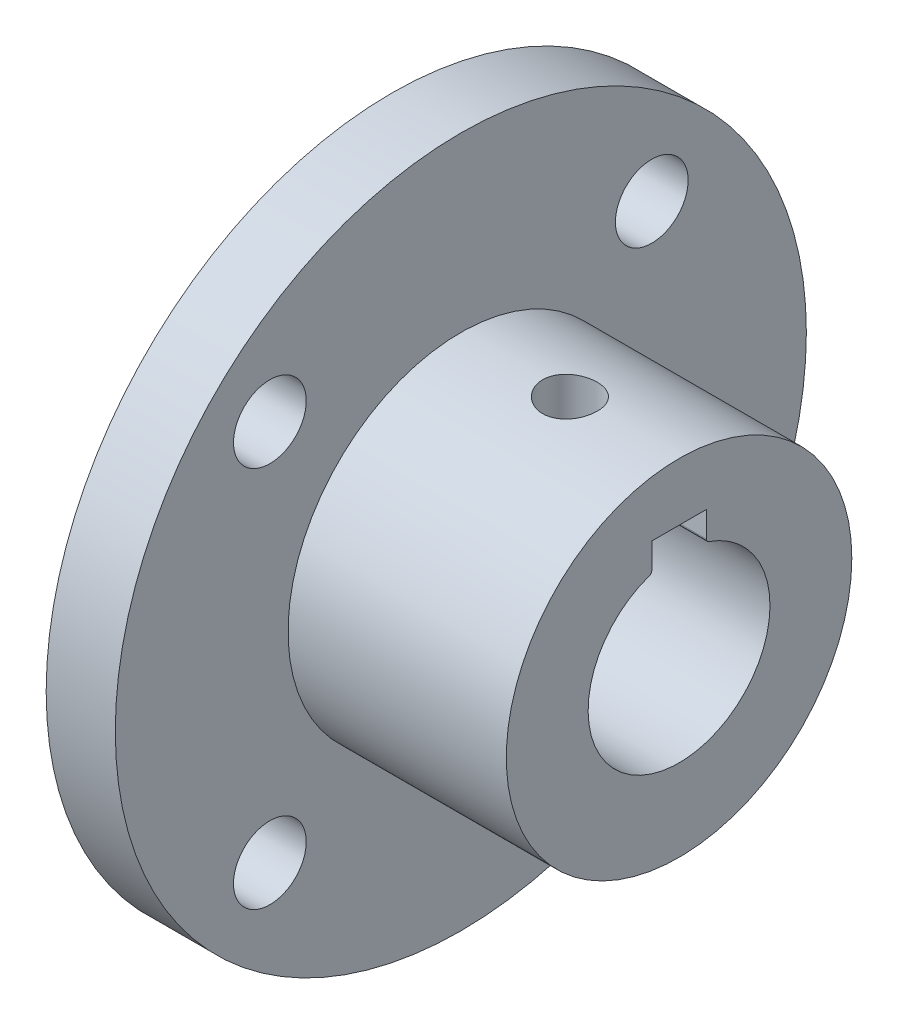
ISO-10303-21;
HEADER;
FILE_DESCRIPTION(('STEP AP214'),'2;1');
FILE_NAME('part.step','',(''),(''),'','','');
FILE_SCHEMA(('AUTOMOTIVE_DESIGN { 1 0 10303 214 1 1 1 1 }'));
ENDSEC;
DATA;
#1=APPLICATION_CONTEXT('core data for automotive mechanical design processes');
#2=APPLICATION_PROTOCOL_DEFINITION('international standard','automotive_design',2000,#1);
#3=PRODUCT_CONTEXT('',#1,'mechanical');
#4=PRODUCT('Part','Part','',(#3));
#5=PRODUCT_RELATED_PRODUCT_CATEGORY('part','',(#4));
#6=PRODUCT_DEFINITION_FORMATION('','',#4);
#7=PRODUCT_DEFINITION_CONTEXT('part definition',#1,'design');
#8=PRODUCT_DEFINITION('design','',#6,#7);
#9=PRODUCT_DEFINITION_SHAPE('','',#8);
#10=(LENGTH_UNIT() NAMED_UNIT(*) SI_UNIT(.MILLI.,.METRE.));
#11=(NAMED_UNIT(*) PLANE_ANGLE_UNIT() SI_UNIT($,.RADIAN.));
#12=(NAMED_UNIT(*) SI_UNIT($,.STERADIAN.) SOLID_ANGLE_UNIT());
#13=UNCERTAINTY_MEASURE_WITH_UNIT(LENGTH_MEASURE(1.E-05),#10,'distance_accuracy_value','');
#14=(GEOMETRIC_REPRESENTATION_CONTEXT(3) GLOBAL_UNCERTAINTY_ASSIGNED_CONTEXT((#13)) GLOBAL_UNIT_ASSIGNED_CONTEXT((#10,
#11,#12)) REPRESENTATION_CONTEXT('',''));
#15=CARTESIAN_POINT('',(0.,0.,0.));
#16=DIRECTION('',(0.,0.,1.));
#17=DIRECTION('',(1.,0.,0.));
#18=AXIS2_PLACEMENT_3D('',#15,#16,#17);
#19=CARTESIAN_POINT('',(-8.,6.31969600708473,1.5));
#20=DIRECTION('',(0.,1.,0.));
#21=DIRECTION('',(0.,0.,1.));
#22=AXIS2_PLACEMENT_3D('',#19,#20,#21);
#23=PLANE('',#22);
#24=DIRECTION('',(1.,0.,0.));
#25=VECTOR('',#24,1.);
#26=CARTESIAN_POINT('',(-8.,6.31969600708473,1.5));
#27=LINE('',#26,#25);
#28=CARTESIAN_POINT('',(6.,6.31969600708473,1.5));
#29=VERTEX_POINT('',#28);
#30=CARTESIAN_POINT('',(12.,6.31969600708473,1.5));
#31=VERTEX_POINT('',#30);
#32=EDGE_CURVE('E102',#29,#31,#27,.T.);
#33=ORIENTED_EDGE('',*,*,#32,.F.);
#34=CARTESIAN_POINT('',(6.,6.31969600708473,0.));
#35=DIRECTION('',(0.,-1.,0.));
#36=DIRECTION('',(0.,0.,-1.));
#37=AXIS2_PLACEMENT_3D('',#34,#35,#36);
#38=CIRCLE('',#37,1.5);
#39=CARTESIAN_POINT('',(6.,6.31969600708473,-1.5));
#40=VERTEX_POINT('',#39);
#41=EDGE_CURVE('E47',#40,#29,#38,.T.);
#42=ORIENTED_EDGE('',*,*,#41,.F.);
#43=DIRECTION('',(1.,0.,0.));
#44=VECTOR('',#43,1.);
#45=CARTESIAN_POINT('',(-8.,6.31969600708473,-1.5));
#46=LINE('',#45,#44);
#47=CARTESIAN_POINT('',(12.,6.31969600708473,-1.5));
#48=VERTEX_POINT('',#47);
#49=EDGE_CURVE('E100',#40,#48,#46,.T.);
#50=ORIENTED_EDGE('',*,*,#49,.T.);
#51=DIRECTION('',(0.,0.,1.));
#52=VECTOR('',#51,1.);
#53=CARTESIAN_POINT('',(12.,6.31969600708473,1.5));
#54=LINE('',#53,#52);
#55=EDGE_CURVE('E197',#48,#31,#54,.T.);
#56=ORIENTED_EDGE('',*,*,#55,.T.);
#57=EDGE_LOOP('',(#33,#42,#50,#56));
#58=FACE_BOUND('',#57,.T.);
#59=ADVANCED_FACE('F32',(#58),#23,.F.);
#60=CARTESIAN_POINT('',(12.,0.,0.));
#61=DIRECTION('',(-1.,0.,0.));
#62=DIRECTION('',(0.,0.,1.));
#63=AXIS2_PLACEMENT_3D('',#60,#61,#62);
#64=CYLINDRICAL_SURFACE('',#63,9.5);
#65=CARTESIAN_POINT('',(6.,9.38083151964686,-1.49999999999999));
#66=CARTESIAN_POINT('',(6.08369026900603,9.38083297404067,-1.49999658455055));
#67=CARTESIAN_POINT('',(6.16742779423957,9.38196360092029,-1.49297223784083));
#68=CARTESIAN_POINT('',(6.33255780369293,9.38636039550341,-1.46507009131937));
#69=CARTESIAN_POINT('',(6.41394798122975,9.38962859377943,-1.4441791187131));
#70=CARTESIAN_POINT('',(6.57196937318476,9.39792135372632,-1.38918760267278));
#71=CARTESIAN_POINT('',(6.64860433286139,9.40294451195283,-1.35509761216465));
#72=CARTESIAN_POINT('',(6.79505691023552,9.414179545352,-1.27470128030858));
#73=CARTESIAN_POINT('',(6.86487538572664,9.42039127066217,-1.22839647880732));
#74=CARTESIAN_POINT('',(6.99634124408723,9.43336503838525,-1.12444713836386));
#75=CARTESIAN_POINT('',(7.05791948431348,9.44013105201472,-1.06671563821397));
#76=CARTESIAN_POINT('',(7.17055707457265,9.45341567106039,-0.941739545888714));
#77=CARTESIAN_POINT('',(7.2216158257772,9.45993426237471,-0.874494412511269));
#78=CARTESIAN_POINT('',(7.31202225596456,9.47203134599669,-0.731954548292155));
#79=CARTESIAN_POINT('',(7.3513059429926,9.47760463238818,-0.656618750818351));
#80=CARTESIAN_POINT('',(7.41663616562531,9.48713906529767,-0.500315336961964));
#81=CARTESIAN_POINT('',(7.44268347476685,9.49110030602129,-0.419348049999336));
#82=CARTESIAN_POINT('',(7.48059106781324,9.49693629805995,-0.254793214503924));
#83=CARTESIAN_POINT('',(7.49256732681613,9.4988280968723,-0.171232996932493));
#84=CARTESIAN_POINT('',(7.50235320946522,9.5003705446193,-0.00326909893888364));
#85=CARTESIAN_POINT('',(7.500163701559,9.50002133094165,0.0811345294603377));
#86=CARTESIAN_POINT('',(7.48177122817933,9.49713466336619,0.247597304848648));
#87=CARTESIAN_POINT('',(7.46569305224062,9.49461669627846,0.329670625893907));
#88=CARTESIAN_POINT('',(7.42017580832943,9.48769715323518,0.489939598315306));
#89=CARTESIAN_POINT('',(7.39073636681562,9.48329552461823,0.568135141212472));
#90=CARTESIAN_POINT('',(7.31920624384709,9.47306987014885,0.718803540216128));
#91=CARTESIAN_POINT('',(7.27706354287449,9.46724001448607,0.791251288178864));
#92=CARTESIAN_POINT('',(7.18136121647326,9.45480671150477,0.928093849593971));
#93=CARTESIAN_POINT('',(7.12780075978403,9.44820320787719,0.992488076174242));
#94=CARTESIAN_POINT('',(7.01008952388599,9.43487320037046,1.11213206749231));
#95=CARTESIAN_POINT('',(6.94582973723023,9.42814614020982,1.16727457805415));
#96=CARTESIAN_POINT('',(6.8089128758329,9.41539709463342,1.266010929629));
#97=CARTESIAN_POINT('',(6.73625573821376,9.40937511449785,1.30960468415936));
#98=CARTESIAN_POINT('',(6.58448905356292,9.39871800561222,1.38402357522716));
#99=CARTESIAN_POINT('',(6.50537357784112,9.3940841698043,1.4148368179779));
#100=CARTESIAN_POINT('',(6.34300057940931,9.38675017598398,1.46270749784294));
#101=CARTESIAN_POINT('',(6.25974338247691,9.38404986614158,1.47976601505947));
#102=CARTESIAN_POINT('',(6.09240704434115,9.38091773533559,1.49949411042943));
#103=CARTESIAN_POINT('',(6.00834630878176,9.38046188392375,1.50231612080203));
#104=CARTESIAN_POINT('',(5.84095294106696,9.38180638869071,1.49389636898111));
#105=CARTESIAN_POINT('',(5.7576202838832,9.38360666700331,1.4826550921564));
#106=CARTESIAN_POINT('',(5.5945263306373,9.38923845197488,1.44655746438408));
#107=CARTESIAN_POINT('',(5.51474762828654,9.39305851175888,1.42177781446732));
#108=CARTESIAN_POINT('',(5.36047565928388,9.4022899197254,1.35938693205191));
#109=CARTESIAN_POINT('',(5.28598267961056,9.40770135422673,1.3217750034913));
#110=CARTESIAN_POINT('',(5.14371568468304,9.41956203589073,1.23442398163625));
#111=CARTESIAN_POINT('',(5.07600267439463,9.42601953670219,1.18458667109845));
#112=CARTESIAN_POINT('',(4.94984651140742,9.43922022959441,1.07433532022964));
#113=CARTESIAN_POINT('',(4.89140394197003,9.44596343961713,1.01392061491125));
#114=CARTESIAN_POINT('',(4.78489596206669,9.45905128553892,0.883556250112785));
#115=CARTESIAN_POINT('',(4.73693186623677,9.46539164279549,0.813523322567934));
#116=CARTESIAN_POINT('',(4.65344996877065,9.47689193046182,0.666305394879823));
#117=CARTESIAN_POINT('',(4.61793179729558,9.48205189594613,0.589120607345015));
#118=CARTESIAN_POINT('',(4.56050991982398,9.49059133505206,0.430099180755799));
#119=CARTESIAN_POINT('',(4.53855191810453,9.49397790107198,0.348282544696116));
#120=CARTESIAN_POINT('',(4.50869836202957,9.49861883842448,0.182065541000527));
#121=CARTESIAN_POINT('',(4.5008017739929,9.49987336648691,0.0976653637496392));
#122=CARTESIAN_POINT('',(4.49932251388065,9.50010700904781,-0.0703424890561619));
#123=CARTESIAN_POINT('',(4.50558522619841,9.49911070212592,-0.153948809855678));
#124=CARTESIAN_POINT('',(4.531913990174,9.49500446266303,-0.318903288593765));
#125=CARTESIAN_POINT('',(4.55197998308508,9.4918945391176,-0.400251456141503));
#126=CARTESIAN_POINT('',(4.60528876135925,9.48390902705529,-0.558330315524412));
#127=CARTESIAN_POINT('',(4.63851970894955,9.47903502511628,-0.635065084473795));
#128=CARTESIAN_POINT('',(4.71719828692583,9.46805518209959,-0.781893871437115));
#129=CARTESIAN_POINT('',(4.76264639913754,9.46194929244058,-0.85198762739247));
#130=CARTESIAN_POINT('',(4.86502327636151,9.44910438099924,-0.984326499290171));
#131=CARTESIAN_POINT('',(4.92206578433182,9.44235947063351,-1.04648306132952));
#132=CARTESIAN_POINT('',(5.04577303306463,9.42903896923987,-1.16039729972464));
#133=CARTESIAN_POINT('',(5.112440025773,9.42246341826431,-1.21215253557011));
#134=CARTESIAN_POINT('',(5.25399843148187,9.4101817273596,-1.30409009743287));
#135=CARTESIAN_POINT('',(5.32893884931402,9.40448130469082,-1.34419772972857));
#136=CARTESIAN_POINT('',(5.48454975225172,9.39466254048804,-1.41119529560834));
#137=CARTESIAN_POINT('',(5.56521429625701,9.39054258623338,-1.43809871074204));
#138=CARTESIAN_POINT('',(5.70518287178885,9.38528558640041,-1.47193913254665));
#139=CARTESIAN_POINT('',(5.76362996598427,9.38362436450214,-1.48244550005067));
#140=CARTESIAN_POINT('',(5.88137680063346,9.38139682399236,-1.49647709113171));
#141=CARTESIAN_POINT('',(5.94067652808826,9.38083048870633,-1.50000242102602));
#142=CARTESIAN_POINT('',(6.,9.38083151964686,-1.49999999999999));
#143=B_SPLINE_CURVE_WITH_KNOTS('',3,(#65,#66,#67,#68,#69,#70,#71,#72,#73,#74,#75,#76,#77,#78,
#79,#80,#81,#82,#83,#84,#85,#86,#87,#88,#89,#90,#91,#92,#93,#94,#95,#96,#97,#98,#99,#100,#101,
#102,#103,#104,#105,#106,#107,#108,#109,#110,#111,#112,#113,#114,#115,#116,#117,#118,#119,#120,
#121,#122,#123,#124,#125,#126,#127,#128,#129,#130,#131,#132,#133,#134,#135,#136,#137,#138,#139,
#140,#141,#142),.UNSPECIFIED.,.T.,.F.,(4,2,2,2,2,2,2,2,2,2,2,2,2,2,2,2,2,2,2,2,2,2,2,2,2,2,2,2,
2,2,2,2,2,2,2,2,2,2,4),(0.,0.250853927262165,0.501946498416268,0.752838728320958,
1.00369934487581,1.2565480788977,1.50941120251429,1.76362459165417,2.01782312279828,
2.26991148848838,2.52198439977627,2.77181572176523,3.02165402872708,3.27252964579772,
3.52342353390932,3.77705047333307,4.03067931198403,4.28454365571369,4.5383880625751,
4.78950866646251,5.04062060361752,5.29032441173718,5.54004176670728,5.79183509438419,
6.04364425767606,6.2977898062082,6.55192780199649,6.8050415020287,7.05813659442521,
7.30848132386848,7.55882498785123,7.80894405482681,8.05907298755212,8.31178569360907,
8.56455762574337,8.81891644248641,9.07301501496294,9.25083440456604,9.42865108605877),.UNSPECIFIED.);
#144=CARTESIAN_POINT('',(6.,9.38083151964686,-1.49999999999999));
#145=VERTEX_POINT('',#144);
#146=EDGE_CURVE('E104',#145,#145,#143,.T.);
#147=ORIENTED_EDGE('',*,*,#146,.T.);
#148=EDGE_LOOP('',(#147));
#149=FACE_BOUND('',#148,.T.);
#150=CARTESIAN_POINT('',(12.,0.,0.));
#151=DIRECTION('',(1.,0.,0.));
#152=DIRECTION('',(0.,0.,-1.));
#153=AXIS2_PLACEMENT_3D('',#150,#151,#152);
#154=CIRCLE('',#153,9.5);
#155=CARTESIAN_POINT('',(12.,0.,-9.5));
#156=VERTEX_POINT('',#155);
#157=EDGE_CURVE('E160',#156,#156,#154,.T.);
#158=ORIENTED_EDGE('',*,*,#157,.F.);
#159=EDGE_LOOP('',(#158));
#160=FACE_BOUND('',#159,.T.);
#161=CARTESIAN_POINT('',(0.,0.,0.));
#162=DIRECTION('',(1.,0.,0.));
#163=DIRECTION('',(0.,0.,-1.));
#164=AXIS2_PLACEMENT_3D('',#161,#162,#163);
#165=CIRCLE('',#164,9.5);
#166=CARTESIAN_POINT('',(0.,0.,-9.5));
#167=VERTEX_POINT('',#166);
#168=EDGE_CURVE('E157',#167,#167,#165,.T.);
#169=ORIENTED_EDGE('',*,*,#168,.T.);
#170=EDGE_LOOP('',(#169));
#171=FACE_BOUND('',#170,.T.);
#172=ADVANCED_FACE('F34',(#149,#160,#171),#64,.T.);
#173=CARTESIAN_POINT('',(12.,0.,0.));
#174=DIRECTION('',(1.,0.,0.));
#175=DIRECTION('',(0.,0.,-1.));
#176=AXIS2_PLACEMENT_3D('',#173,#174,#175);
#177=PLANE('',#176);
#178=CARTESIAN_POINT('',(12.,4.91426495012225,1.7));
#179=DIRECTION('',(-1.,0.,0.));
#180=DIRECTION('',(0.,0.,-1.));
#181=AXIS2_PLACEMENT_3D('',#178,#179,#180);
#182=CIRCLE('',#181,0.2);
#183=CARTESIAN_POINT('',(12.,4.91426495012225,1.5));
#184=VERTEX_POINT('',#183);
#185=CARTESIAN_POINT('',(12.,4.72525475973293,1.63461538461538));
#186=VERTEX_POINT('',#185);
#187=EDGE_CURVE('E55',#184,#186,#182,.T.);
#188=ORIENTED_EDGE('',*,*,#187,.F.);
#189=DIRECTION('',(0.,-1.,0.));
#190=VECTOR('',#189,1.);
#191=CARTESIAN_POINT('',(12.,6.31969600708473,1.5));
#192=LINE('',#191,#190);
#193=EDGE_CURVE('E127',#31,#184,#192,.T.);
#194=ORIENTED_EDGE('',*,*,#193,.F.);
#195=ORIENTED_EDGE('',*,*,#55,.F.);
#196=DIRECTION('',(0.,1.,0.));
#197=VECTOR('',#196,1.);
#198=CARTESIAN_POINT('',(12.,6.31969600708473,-1.5));
#199=LINE('',#198,#197);
#200=CARTESIAN_POINT('',(12.,4.91426495012225,-1.5));
#201=VERTEX_POINT('',#200);
#202=EDGE_CURVE('E111',#201,#48,#199,.T.);
#203=ORIENTED_EDGE('',*,*,#202,.F.);
#204=CARTESIAN_POINT('',(12.,4.91426495012225,-1.7));
#205=DIRECTION('',(-1.,0.,0.));
#206=DIRECTION('',(0.,0.,1.));
#207=AXIS2_PLACEMENT_3D('',#204,#205,#206);
#208=CIRCLE('',#207,0.2);
#209=CARTESIAN_POINT('',(12.,4.72525475973293,-1.63461538461539));
#210=VERTEX_POINT('',#209);
#211=EDGE_CURVE('E188',#210,#201,#208,.T.);
#212=ORIENTED_EDGE('',*,*,#211,.F.);
#213=CARTESIAN_POINT('',(12.,0.,0.));
#214=DIRECTION('',(1.,0.,0.));
#215=DIRECTION('',(0.,0.,-1.));
#216=AXIS2_PLACEMENT_3D('',#213,#214,#215);
#217=CIRCLE('',#216,5.);
#218=EDGE_CURVE('E192',#186,#210,#217,.T.);
#219=ORIENTED_EDGE('',*,*,#218,.F.);
#220=EDGE_LOOP('',(#188,#194,#195,#203,#212,#219));
#221=FACE_BOUND('',#220,.T.);
#222=ORIENTED_EDGE('',*,*,#157,.T.);
#223=EDGE_LOOP('',(#222));
#224=FACE_BOUND('',#223,.T.);
#225=ADVANCED_FACE('F194',(#221,#224),#177,.T.);
#226=CARTESIAN_POINT('',(-3.8,0.,0.));
#227=DIRECTION('',(-1.,0.,0.));
#228=DIRECTION('',(0.,0.,1.));
#229=AXIS2_PLACEMENT_3D('',#226,#227,#228);
#230=PLANE('',#229);
#231=CARTESIAN_POINT('',(-3.8,4.91426495012225,1.7));
#232=DIRECTION('',(-1.,0.,0.));
#233=DIRECTION('',(0.,0.,1.));
#234=AXIS2_PLACEMENT_3D('',#231,#232,#233);
#235=CIRCLE('',#234,0.2);
#236=CARTESIAN_POINT('',(-3.8,4.72525475973293,1.63461538461538));
#237=VERTEX_POINT('',#236);
#238=CARTESIAN_POINT('',(-3.8,4.91426495012225,1.5));
#239=VERTEX_POINT('',#238);
#240=EDGE_CURVE('E11',#237,#239,#235,.F.);
#241=ORIENTED_EDGE('',*,*,#240,.F.);
#242=CARTESIAN_POINT('',(-3.8,0.,0.));
#243=DIRECTION('',(-1.,0.,0.));
#244=DIRECTION('',(0.,0.,1.));
#245=AXIS2_PLACEMENT_3D('',#242,#243,#244);
#246=CIRCLE('',#245,5.);
#247=CARTESIAN_POINT('',(-3.8,4.72525475973293,-1.63461538461539));
#248=VERTEX_POINT('',#247);
#249=EDGE_CURVE('E163',#248,#237,#246,.T.);
#250=ORIENTED_EDGE('',*,*,#249,.F.);
#251=CARTESIAN_POINT('',(-3.8,4.91426495012225,-1.7));
#252=DIRECTION('',(-1.,0.,0.));
#253=DIRECTION('',(0.,0.,1.));
#254=AXIS2_PLACEMENT_3D('',#251,#252,#253);
#255=CIRCLE('',#254,0.2);
#256=CARTESIAN_POINT('',(-3.8,4.91426495012225,-1.5));
#257=VERTEX_POINT('',#256);
#258=EDGE_CURVE('E167',#257,#248,#255,.F.);
#259=ORIENTED_EDGE('',*,*,#258,.F.);
#260=DIRECTION('',(0.,-1.,0.));
#261=VECTOR('',#260,1.);
#262=CARTESIAN_POINT('',(-3.8,0.,-1.50000000000001));
#263=LINE('',#262,#261);
#264=CARTESIAN_POINT('',(-3.8,6.31969600708473,-1.5));
#265=VERTEX_POINT('',#264);
#266=EDGE_CURVE('E170',#265,#257,#263,.T.);
#267=ORIENTED_EDGE('',*,*,#266,.F.);
#268=DIRECTION('',(0.,0.,-1.));
#269=VECTOR('',#268,1.);
#270=CARTESIAN_POINT('',(-3.8,6.31969600708473,0.));
#271=LINE('',#270,#269);
#272=CARTESIAN_POINT('',(-3.8,6.31969600708473,1.5));
#273=VERTEX_POINT('',#272);
#274=EDGE_CURVE('E117',#273,#265,#271,.T.);
#275=ORIENTED_EDGE('',*,*,#274,.F.);
#276=DIRECTION('',(0.,1.,0.));
#277=VECTOR('',#276,1.);
#278=CARTESIAN_POINT('',(-3.8,0.,1.5));
#279=LINE('',#278,#277);
#280=EDGE_CURVE('E41',#239,#273,#279,.T.);
#281=ORIENTED_EDGE('',*,*,#280,.F.);
#282=EDGE_LOOP('',(#241,#250,#259,#267,#275,#281));
#283=FACE_BOUND('',#282,.T.);
#284=CARTESIAN_POINT('',(-3.8,-10.5,10.5));
#285=DIRECTION('',(-1.,0.,0.));
#286=DIRECTION('',(0.,0.,1.));
#287=AXIS2_PLACEMENT_3D('',#284,#285,#286);
#288=CIRCLE('',#287,2.);
#289=CARTESIAN_POINT('',(-3.8,-10.5,12.5));
#290=VERTEX_POINT('',#289);
#291=EDGE_CURVE('E136',#290,#290,#288,.T.);
#292=ORIENTED_EDGE('',*,*,#291,.F.);
#293=EDGE_LOOP('',(#292));
#294=FACE_BOUND('',#293,.T.);
#295=CARTESIAN_POINT('',(-3.8,10.5,-10.5));
#296=DIRECTION('',(-1.,0.,0.));
#297=DIRECTION('',(0.,0.,1.));
#298=AXIS2_PLACEMENT_3D('',#295,#296,#297);
#299=CIRCLE('',#298,2.);
#300=CARTESIAN_POINT('',(-3.8,10.5,-8.5));
#301=VERTEX_POINT('',#300);
#302=EDGE_CURVE('E148',#301,#301,#299,.T.);
#303=ORIENTED_EDGE('',*,*,#302,.F.);
#304=EDGE_LOOP('',(#303));
#305=FACE_BOUND('',#304,.T.);
#306=CARTESIAN_POINT('',(-3.8,0.,0.));
#307=DIRECTION('',(-1.,0.,0.));
#308=DIRECTION('',(0.,0.,1.));
#309=AXIS2_PLACEMENT_3D('',#306,#307,#308);
#310=CIRCLE('',#309,19.);
#311=CARTESIAN_POINT('',(-3.8,0.,19.));
#312=VERTEX_POINT('',#311);
#313=EDGE_CURVE('E154',#312,#312,#310,.T.);
#314=ORIENTED_EDGE('',*,*,#313,.T.);
#315=EDGE_LOOP('',(#314));
#316=FACE_BOUND('',#315,.T.);
#317=CARTESIAN_POINT('',(-3.8,10.5,10.5));
#318=DIRECTION('',(-1.,0.,0.));
#319=DIRECTION('',(0.,0.,-1.));
#320=AXIS2_PLACEMENT_3D('',#317,#318,#319);
#321=CIRCLE('',#320,2.);
#322=CARTESIAN_POINT('',(-3.8,10.5,8.5));
#323=VERTEX_POINT('',#322);
#324=EDGE_CURVE('E142',#323,#323,#321,.T.);
#325=ORIENTED_EDGE('',*,*,#324,.F.);
#326=EDGE_LOOP('',(#325));
#327=FACE_BOUND('',#326,.T.);
#328=CARTESIAN_POINT('',(-3.8,-10.5,-10.5));
#329=DIRECTION('',(-1.,0.,0.));
#330=DIRECTION('',(0.,0.,-1.));
#331=AXIS2_PLACEMENT_3D('',#328,#329,#330);
#332=CIRCLE('',#331,2.);
#333=CARTESIAN_POINT('',(-3.8,-10.5,-12.5));
#334=VERTEX_POINT('',#333);
#335=EDGE_CURVE('E128',#334,#334,#332,.T.);
#336=ORIENTED_EDGE('',*,*,#335,.F.);
#337=EDGE_LOOP('',(#336));
#338=FACE_BOUND('',#337,.T.);
#339=ADVANCED_FACE('F179',(#283,#294,#305,#316,#327,#338),#230,.T.);
#340=CARTESIAN_POINT('',(0.,0.,0.));
#341=DIRECTION('',(-1.,0.,0.));
#342=DIRECTION('',(0.,0.,1.));
#343=AXIS2_PLACEMENT_3D('',#340,#341,#342);
#344=PLANE('',#343);
#345=ORIENTED_EDGE('',*,*,#168,.F.);
#346=EDGE_LOOP('',(#345));
#347=FACE_BOUND('',#346,.T.);
#348=CARTESIAN_POINT('',(0.,0.,0.));
#349=DIRECTION('',(-1.,0.,0.));
#350=DIRECTION('',(0.,0.,1.));
#351=AXIS2_PLACEMENT_3D('',#348,#349,#350);
#352=CIRCLE('',#351,19.);
#353=CARTESIAN_POINT('',(0.,0.,19.));
#354=VERTEX_POINT('',#353);
#355=EDGE_CURVE('E151',#354,#354,#352,.T.);
#356=ORIENTED_EDGE('',*,*,#355,.F.);
#357=EDGE_LOOP('',(#356));
#358=FACE_BOUND('',#357,.T.);
#359=CARTESIAN_POINT('',(0.,10.5,-10.5));
#360=DIRECTION('',(-1.,0.,0.));
#361=DIRECTION('',(0.,0.,1.));
#362=AXIS2_PLACEMENT_3D('',#359,#360,#361);
#363=CIRCLE('',#362,2.);
#364=CARTESIAN_POINT('',(0.,10.5,-8.5));
#365=VERTEX_POINT('',#364);
#366=EDGE_CURVE('E145',#365,#365,#363,.T.);
#367=ORIENTED_EDGE('',*,*,#366,.T.);
#368=EDGE_LOOP('',(#367));
#369=FACE_BOUND('',#368,.T.);
#370=CARTESIAN_POINT('',(0.,10.5,10.5));
#371=DIRECTION('',(-1.,0.,0.));
#372=DIRECTION('',(0.,0.,-1.));
#373=AXIS2_PLACEMENT_3D('',#370,#371,#372);
#374=CIRCLE('',#373,2.);
#375=CARTESIAN_POINT('',(0.,10.5,8.5));
#376=VERTEX_POINT('',#375);
#377=EDGE_CURVE('E139',#376,#376,#374,.T.);
#378=ORIENTED_EDGE('',*,*,#377,.T.);
#379=EDGE_LOOP('',(#378));
#380=FACE_BOUND('',#379,.T.);
#381=CARTESIAN_POINT('',(0.,-10.5,10.5));
#382=DIRECTION('',(-1.,0.,0.));
#383=DIRECTION('',(0.,0.,1.));
#384=AXIS2_PLACEMENT_3D('',#381,#382,#383);
#385=CIRCLE('',#384,2.);
#386=CARTESIAN_POINT('',(0.,-10.5,12.5));
#387=VERTEX_POINT('',#386);
#388=EDGE_CURVE('E131',#387,#387,#385,.T.);
#389=ORIENTED_EDGE('',*,*,#388,.T.);
#390=EDGE_LOOP('',(#389));
#391=FACE_BOUND('',#390,.T.);
#392=CARTESIAN_POINT('',(0.,-10.5,-10.5));
#393=DIRECTION('',(-1.,0.,0.));
#394=DIRECTION('',(0.,0.,-1.));
#395=AXIS2_PLACEMENT_3D('',#392,#393,#394);
#396=CIRCLE('',#395,2.);
#397=CARTESIAN_POINT('',(0.,-10.5,-12.5));
#398=VERTEX_POINT('',#397);
#399=EDGE_CURVE('E132',#398,#398,#396,.T.);
#400=ORIENTED_EDGE('',*,*,#399,.T.);
#401=EDGE_LOOP('',(#400));
#402=FACE_BOUND('',#401,.T.);
#403=ADVANCED_FACE('F246',(#347,#358,#369,#380,#391,#402),#344,.F.);
#404=CARTESIAN_POINT('',(-3.8,0.,0.));
#405=DIRECTION('',(1.,0.,0.));
#406=DIRECTION('',(0.,0.,-1.));
#407=AXIS2_PLACEMENT_3D('',#404,#405,#406);
#408=CYLINDRICAL_SURFACE('',#407,19.);
#409=ORIENTED_EDGE('',*,*,#313,.F.);
#410=EDGE_LOOP('',(#409));
#411=FACE_BOUND('',#410,.T.);
#412=ORIENTED_EDGE('',*,*,#355,.T.);
#413=EDGE_LOOP('',(#412));
#414=FACE_BOUND('',#413,.T.);
#415=ADVANCED_FACE('F242',(#411,#414),#408,.T.);
#416=CARTESIAN_POINT('',(-3.8,10.5,-10.5));
#417=DIRECTION('',(1.,0.,0.));
#418=DIRECTION('',(0.,0.,-1.));
#419=AXIS2_PLACEMENT_3D('',#416,#417,#418);
#420=CYLINDRICAL_SURFACE('',#419,2.);
#421=ORIENTED_EDGE('',*,*,#302,.T.);
#422=EDGE_LOOP('',(#421));
#423=FACE_BOUND('',#422,.T.);
#424=ORIENTED_EDGE('',*,*,#366,.F.);
#425=EDGE_LOOP('',(#424));
#426=FACE_BOUND('',#425,.T.);
#427=ADVANCED_FACE('F238',(#423,#426),#420,.F.);
#428=CARTESIAN_POINT('',(-3.8,10.5,10.5));
#429=DIRECTION('',(1.,0.,0.));
#430=DIRECTION('',(0.,0.,-1.));
#431=AXIS2_PLACEMENT_3D('',#428,#429,#430);
#432=CYLINDRICAL_SURFACE('',#431,2.);
#433=ORIENTED_EDGE('',*,*,#324,.T.);
#434=EDGE_LOOP('',(#433));
#435=FACE_BOUND('',#434,.T.);
#436=ORIENTED_EDGE('',*,*,#377,.F.);
#437=EDGE_LOOP('',(#436));
#438=FACE_BOUND('',#437,.T.);
#439=ADVANCED_FACE('F234',(#435,#438),#432,.F.);
#440=CARTESIAN_POINT('',(-3.8,-10.5,10.5));
#441=DIRECTION('',(1.,0.,0.));
#442=DIRECTION('',(0.,0.,-1.));
#443=AXIS2_PLACEMENT_3D('',#440,#441,#442);
#444=CYLINDRICAL_SURFACE('',#443,2.);
#445=ORIENTED_EDGE('',*,*,#291,.T.);
#446=EDGE_LOOP('',(#445));
#447=FACE_BOUND('',#446,.T.);
#448=ORIENTED_EDGE('',*,*,#388,.F.);
#449=EDGE_LOOP('',(#448));
#450=FACE_BOUND('',#449,.T.);
#451=ADVANCED_FACE('F230',(#447,#450),#444,.F.);
#452=CARTESIAN_POINT('',(-3.8,-10.5,-10.5));
#453=DIRECTION('',(1.,0.,0.));
#454=DIRECTION('',(0.,0.,-1.));
#455=AXIS2_PLACEMENT_3D('',#452,#453,#454);
#456=CYLINDRICAL_SURFACE('',#455,2.);
#457=ORIENTED_EDGE('',*,*,#335,.T.);
#458=EDGE_LOOP('',(#457));
#459=FACE_BOUND('',#458,.T.);
#460=ORIENTED_EDGE('',*,*,#399,.F.);
#461=EDGE_LOOP('',(#460));
#462=FACE_BOUND('',#461,.T.);
#463=ADVANCED_FACE('F227',(#459,#462),#456,.F.);
#464=CARTESIAN_POINT('',(-8.,4.91426495012225,1.7));
#465=DIRECTION('',(1.,0.,0.));
#466=DIRECTION('',(0.,0.,-1.));
#467=AXIS2_PLACEMENT_3D('',#464,#465,#466);
#468=CYLINDRICAL_SURFACE('',#467,0.2);
#469=ORIENTED_EDGE('',*,*,#240,.T.);
#470=DIRECTION('',(1.,0.,0.));
#471=VECTOR('',#470,1.);
#472=CARTESIAN_POINT('',(-8.,4.91426495012225,1.5));
#473=LINE('',#472,#471);
#474=EDGE_CURVE('E135',#239,#184,#473,.T.);
#475=ORIENTED_EDGE('',*,*,#474,.T.);
#476=ORIENTED_EDGE('',*,*,#187,.T.);
#477=DIRECTION('',(1.,0.,0.));
#478=VECTOR('',#477,1.);
#479=CARTESIAN_POINT('',(-8.,4.72525475973293,1.63461538461538));
#480=LINE('',#479,#478);
#481=EDGE_CURVE('E125',#237,#186,#480,.T.);
#482=ORIENTED_EDGE('',*,*,#481,.F.);
#483=EDGE_LOOP('',(#469,#475,#476,#482));
#484=FACE_BOUND('',#483,.T.);
#485=ADVANCED_FACE('F202',(#484),#468,.T.);
#486=CARTESIAN_POINT('',(-8.,6.31969600708473,1.5));
#487=DIRECTION('',(0.,0.,1.));
#488=DIRECTION('',(0.,-1.,0.));
#489=AXIS2_PLACEMENT_3D('',#486,#487,#488);
#490=PLANE('',#489);
#491=ORIENTED_EDGE('',*,*,#280,.T.);
#492=EDGE_CURVE('E118',#273,#29,#27,.T.);
#493=ORIENTED_EDGE('',*,*,#492,.T.);
#494=ORIENTED_EDGE('',*,*,#32,.T.);
#495=ORIENTED_EDGE('',*,*,#193,.T.);
#496=ORIENTED_EDGE('',*,*,#474,.F.);
#497=EDGE_LOOP('',(#491,#493,#494,#495,#496));
#498=FACE_BOUND('',#497,.T.);
#499=ADVANCED_FACE('F175',(#498),#490,.F.);
#500=EDGE_CURVE('E108',#265,#40,#46,.T.);
#501=ORIENTED_EDGE('',*,*,#500,.T.);
#502=EDGE_CURVE('E89',#29,#40,#38,.T.);
#503=ORIENTED_EDGE('',*,*,#502,.F.);
#504=ORIENTED_EDGE('',*,*,#492,.F.);
#505=ORIENTED_EDGE('',*,*,#274,.T.);
#506=EDGE_LOOP('',(#501,#503,#504,#505));
#507=FACE_BOUND('',#506,.T.);
#508=ADVANCED_FACE('F115',(#507),#23,.F.);
#509=CARTESIAN_POINT('',(-8.,6.31969600708473,-1.5));
#510=DIRECTION('',(0.,0.,-1.));
#511=DIRECTION('',(0.,1.,0.));
#512=AXIS2_PLACEMENT_3D('',#509,#510,#511);
#513=PLANE('',#512);
#514=ORIENTED_EDGE('',*,*,#266,.T.);
#515=DIRECTION('',(1.,0.,0.));
#516=VECTOR('',#515,1.);
#517=CARTESIAN_POINT('',(-8.,4.91426495012225,-1.5));
#518=LINE('',#517,#516);
#519=EDGE_CURVE('E113',#257,#201,#518,.T.);
#520=ORIENTED_EDGE('',*,*,#519,.T.);
#521=ORIENTED_EDGE('',*,*,#202,.T.);
#522=ORIENTED_EDGE('',*,*,#49,.F.);
#523=ORIENTED_EDGE('',*,*,#500,.F.);
#524=EDGE_LOOP('',(#514,#520,#521,#522,#523));
#525=FACE_BOUND('',#524,.T.);
#526=ADVANCED_FACE('F107',(#525),#513,.F.);
#527=CARTESIAN_POINT('',(-8.,4.91426495012225,-1.7));
#528=DIRECTION('',(1.,0.,0.));
#529=DIRECTION('',(0.,0.,-1.));
#530=AXIS2_PLACEMENT_3D('',#527,#528,#529);
#531=CYLINDRICAL_SURFACE('',#530,0.2);
#532=ORIENTED_EDGE('',*,*,#258,.T.);
#533=DIRECTION('',(1.,0.,0.));
#534=VECTOR('',#533,1.);
#535=CARTESIAN_POINT('',(-8.,4.72525475973293,-1.63461538461539));
#536=LINE('',#535,#534);
#537=EDGE_CURVE('E123',#248,#210,#536,.T.);
#538=ORIENTED_EDGE('',*,*,#537,.T.);
#539=ORIENTED_EDGE('',*,*,#211,.T.);
#540=ORIENTED_EDGE('',*,*,#519,.F.);
#541=EDGE_LOOP('',(#532,#538,#539,#540));
#542=FACE_BOUND('',#541,.T.);
#543=ADVANCED_FACE('F186',(#542),#531,.T.);
#544=CARTESIAN_POINT('',(-8.,0.,0.));
#545=DIRECTION('',(1.,0.,0.));
#546=DIRECTION('',(0.,0.,-1.));
#547=AXIS2_PLACEMENT_3D('',#544,#545,#546);
#548=CYLINDRICAL_SURFACE('',#547,5.);
#549=ORIENTED_EDGE('',*,*,#249,.T.);
#550=ORIENTED_EDGE('',*,*,#481,.T.);
#551=ORIENTED_EDGE('',*,*,#218,.T.);
#552=ORIENTED_EDGE('',*,*,#537,.F.);
#553=EDGE_LOOP('',(#549,#550,#551,#552));
#554=FACE_BOUND('',#553,.T.);
#555=ADVANCED_FACE('F213',(#554),#548,.F.);
#556=CARTESIAN_POINT('',(6.,11.3196960070847,0.));
#557=DIRECTION('',(0.,-1.,0.));
#558=DIRECTION('',(0.,0.,-1.));
#559=AXIS2_PLACEMENT_3D('',#556,#557,#558);
#560=CYLINDRICAL_SURFACE('',#559,1.5);
#561=ORIENTED_EDGE('',*,*,#41,.T.);
#562=ORIENTED_EDGE('',*,*,#502,.T.);
#563=EDGE_LOOP('',(#561,#562));
#564=FACE_BOUND('',#563,.T.);
#565=ORIENTED_EDGE('',*,*,#146,.F.);
#566=EDGE_LOOP('',(#565));
#567=FACE_BOUND('',#566,.T.);
#568=ADVANCED_FACE('F90',(#564,#567),#560,.F.);
#569=CLOSED_SHELL('',(#59,#172,#225,#339,#403,#415,#427,#439,#451,#463,#485,#499,#508,#526,#543,
#555,#568));
#570=MANIFOLD_SOLID_BREP('B2',#569);
#571=ADVANCED_BREP_SHAPE_REPRESENTATION('',(#18,#570),#14);
#572=SHAPE_DEFINITION_REPRESENTATION(#9,#571);
ENDSEC;
END-ISO-10303-21;
